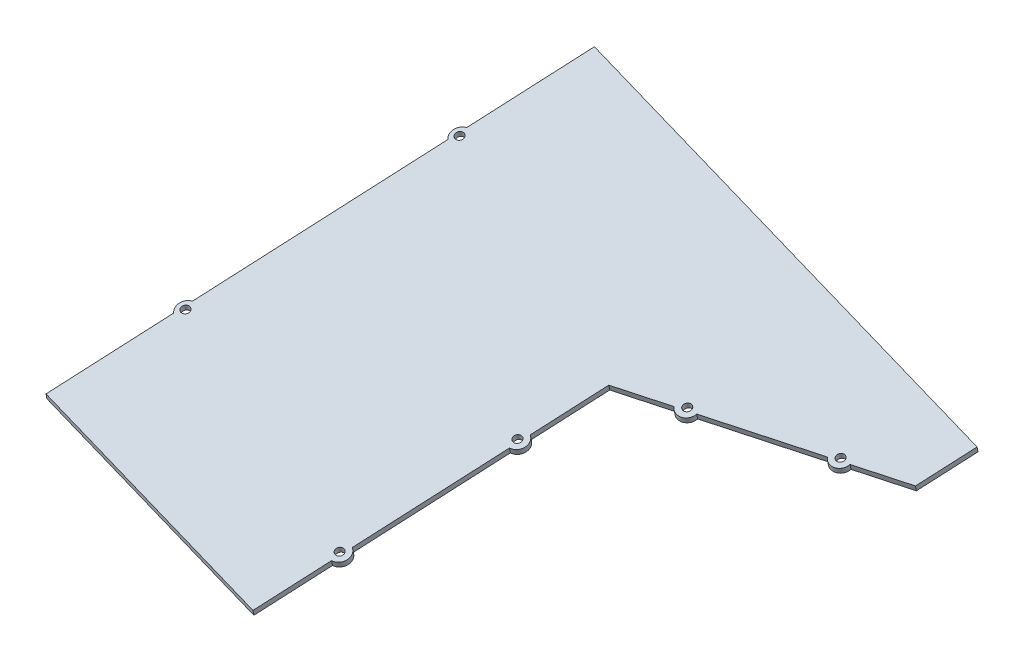
ISO-10303-21;
HEADER;
FILE_DESCRIPTION(('STEP AP214'),'2;1');
FILE_NAME('part.step','',(''),(''),'','','');
FILE_SCHEMA(('AUTOMOTIVE_DESIGN { 1 0 10303 214 1 1 1 1 }'));
ENDSEC;
DATA;
#1=APPLICATION_CONTEXT('core data for automotive mechanical design processes');
#2=APPLICATION_PROTOCOL_DEFINITION('international standard','automotive_design',2000,#1);
#3=PRODUCT_CONTEXT('',#1,'mechanical');
#4=PRODUCT('Part','Part','',(#3));
#5=PRODUCT_RELATED_PRODUCT_CATEGORY('part','',(#4));
#6=PRODUCT_DEFINITION_FORMATION('','',#4);
#7=PRODUCT_DEFINITION_CONTEXT('part definition',#1,'design');
#8=PRODUCT_DEFINITION('design','',#6,#7);
#9=PRODUCT_DEFINITION_SHAPE('','',#8);
#10=(LENGTH_UNIT() NAMED_UNIT(*) SI_UNIT(.MILLI.,.METRE.));
#11=(NAMED_UNIT(*) PLANE_ANGLE_UNIT() SI_UNIT($,.RADIAN.));
#12=(NAMED_UNIT(*) SI_UNIT($,.STERADIAN.) SOLID_ANGLE_UNIT());
#13=UNCERTAINTY_MEASURE_WITH_UNIT(LENGTH_MEASURE(1.E-05),#10,'distance_accuracy_value','');
#14=(GEOMETRIC_REPRESENTATION_CONTEXT(3) GLOBAL_UNCERTAINTY_ASSIGNED_CONTEXT((#13)) GLOBAL_UNIT_ASSIGNED_CONTEXT((#10,
#11,#12)) REPRESENTATION_CONTEXT('',''));
#15=CARTESIAN_POINT('',(0.,0.,0.));
#16=DIRECTION('',(0.,0.,1.));
#17=DIRECTION('',(1.,0.,0.));
#18=AXIS2_PLACEMENT_3D('',#15,#16,#17);
#19=CARTESIAN_POINT('',(354.536635556391,2890.18864910149,758.284890449049));
#20=DIRECTION('',(0.276994280237998,-0.3051480313952,0.911130532718045));
#21=DIRECTION('',(0.,-0.948233420354482,-0.317574212622561));
#22=AXIS2_PLACEMENT_3D('',#19,#20,#21);
#23=PLANE('',#22);
#24=DIRECTION('',(0.118950756916867,0.9518292240618,0.282616074650427));
#25=VECTOR('',#24,1.);
#26=CARTESIAN_POINT('',(327.832889597129,2888.16480171701,765.725330213703));
#27=LINE('',#26,#25);
#28=CARTESIAN_POINT('',(327.832889597129,2888.16480171701,765.725330213703));
#29=VERTEX_POINT('',#28);
#30=CARTESIAN_POINT('',(328.18974186788,2891.0202893892,766.573178437655));
#31=VERTEX_POINT('',#30);
#32=EDGE_CURVE('E174',#29,#31,#27,.T.);
#33=ORIENTED_EDGE('',*,*,#32,.F.);
#34=DIRECTION('',(-0.953480406796248,0.0300966303353959,0.299948840134641));
#35=VECTOR('',#34,1.);
#36=CARTESIAN_POINT('',(354.17978328564,2887.33316142931,757.437042225098));
#37=LINE('',#36,#35);
#38=CARTESIAN_POINT('',(354.17978328564,2887.33316142931,757.437042225098));
#39=VERTEX_POINT('',#38);
#40=EDGE_CURVE('E242',#39,#29,#37,.T.);
#41=ORIENTED_EDGE('',*,*,#40,.F.);
#42=DIRECTION('',(-0.118950756916867,-0.9518292240618,-0.282616074650427));
#43=VECTOR('',#42,1.);
#44=CARTESIAN_POINT('',(354.536635556391,2890.18864910149,758.284890449049));
#45=LINE('',#44,#43);
#46=CARTESIAN_POINT('',(354.536635556391,2890.18864910149,758.284890449049));
#47=VERTEX_POINT('',#46);
#48=EDGE_CURVE('E248',#47,#39,#45,.T.);
#49=ORIENTED_EDGE('',*,*,#48,.F.);
#50=DIRECTION('',(-0.953480406796248,0.0300966303353959,0.299948840134641));
#51=VECTOR('',#50,1.);
#52=CARTESIAN_POINT('',(354.536635556391,2890.18864910149,758.284890449049));
#53=LINE('',#52,#51);
#54=EDGE_CURVE('E50',#47,#31,#53,.T.);
#55=ORIENTED_EDGE('',*,*,#54,.T.);
#56=EDGE_LOOP('',(#33,#41,#49,#55));
#57=FACE_BOUND('',#56,.T.);
#58=ADVANCED_FACE('F33',(#57),#23,.T.);
#59=DIRECTION('',(0.118950756916867,0.9518292240618,0.282616074650427));
#60=VECTOR('',#59,1.);
#61=CARTESIAN_POINT('',(318.737266223133,2888.45190527195,768.586659782602));
#62=LINE('',#61,#60);
#63=CARTESIAN_POINT('',(319.094118493883,2891.30739294414,769.434508006553));
#64=VERTEX_POINT('',#63);
#65=CARTESIAN_POINT('',(318.737266223133,2888.45190527195,768.586659782602));
#66=VERTEX_POINT('',#65);
#67=EDGE_CURVE('E169',#64,#66,#62,.F.);
#68=ORIENTED_EDGE('',*,*,#67,.F.);
#69=CARTESIAN_POINT('',(266.400331116861,2892.97067351955,786.011083983763));
#70=VERTEX_POINT('',#69);
#71=EDGE_CURVE('E161',#64,#70,#53,.T.);
#72=ORIENTED_EDGE('',*,*,#71,.T.);
#73=DIRECTION('',(0.118950756916867,0.9518292240618,0.282616074650427));
#74=VECTOR('',#73,1.);
#75=CARTESIAN_POINT('',(266.043478846111,2890.11518584736,785.163235759812));
#76=LINE('',#75,#74);
#77=CARTESIAN_POINT('',(266.043478846111,2890.11518584736,785.163235759812));
#78=VERTEX_POINT('',#77);
#79=EDGE_CURVE('E11',#78,#70,#76,.T.);
#80=ORIENTED_EDGE('',*,*,#79,.F.);
#81=EDGE_CURVE('E58',#66,#78,#37,.T.);
#82=ORIENTED_EDGE('',*,*,#81,.F.);
#83=EDGE_LOOP('',(#68,#72,#80,#82));
#84=FACE_BOUND('',#83,.T.);
#85=ADVANCED_FACE('F170',(#84),#23,.T.);
#86=CARTESIAN_POINT('',(197.999438910728,2852.03828106166,952.657603691287));
#87=DIRECTION('',(0.97245536084359,-0.169146641830463,0.160374513947948));
#88=DIRECTION('',(0.171364746471442,0.985207655099562,0.));
#89=AXIS2_PLACEMENT_3D('',#86,#87,#88);
#90=PLANE('',#89);
#91=DIRECTION('',(0.118950756916867,0.9518292240618,0.282616074650427));
#92=VECTOR('',#91,1.);
#93=CARTESIAN_POINT('',(206.838278911782,2860.91545033674,908.424677921514));
#94=LINE('',#93,#92);
#95=CARTESIAN_POINT('',(206.838278911782,2860.91545033674,908.424677921514));
#96=VERTEX_POINT('',#95);
#97=CARTESIAN_POINT('',(207.195131182532,2863.77093800892,909.272526145465));
#98=VERTEX_POINT('',#97);
#99=EDGE_CURVE('E198',#96,#98,#94,.T.);
#100=ORIENTED_EDGE('',*,*,#99,.F.);
#101=DIRECTION('',(-0.200452709124791,-0.255754847030097,0.945731552622172));
#102=VECTOR('',#101,1.);
#103=CARTESIAN_POINT('',(197.642586639978,2849.18279338947,951.809755467336));
#104=LINE('',#103,#102);
#105=CARTESIAN_POINT('',(221.405269511798,2879.50127274274,839.697930863136));
#106=VERTEX_POINT('',#105);
#107=EDGE_CURVE('E281',#106,#96,#104,.T.);
#108=ORIENTED_EDGE('',*,*,#107,.F.);
#109=DIRECTION('',(0.118950756916867,0.9518292240618,0.282616074650427));
#110=VECTOR('',#109,1.);
#111=CARTESIAN_POINT('',(221.405269511798,2879.50127274274,839.697930863136));
#112=LINE('',#111,#110);
#113=CARTESIAN_POINT('',(221.762121782549,2882.35676041493,840.545779087087));
#114=VERTEX_POINT('',#113);
#115=EDGE_CURVE('E205',#114,#106,#112,.F.);
#116=ORIENTED_EDGE('',*,*,#115,.F.);
#117=DIRECTION('',(-0.200452709124791,-0.255754847030097,0.945731552622172));
#118=VECTOR('',#117,1.);
#119=CARTESIAN_POINT('',(197.999438910728,2852.03828106166,952.657603691287));
#120=LINE('',#119,#118);
#121=EDGE_CURVE('E266',#114,#98,#120,.T.);
#122=ORIENTED_EDGE('',*,*,#121,.T.);
#123=EDGE_LOOP('',(#100,#108,#116,#122));
#124=FACE_BOUND('',#123,.T.);
#125=ADVANCED_FACE('F349',(#124),#90,.T.);
#126=DIRECTION('',(0.118950756916867,0.9518292240618,0.282616074650427));
#127=VECTOR('',#126,1.);
#128=CARTESIAN_POINT('',(223.317466483593,2881.94101848701,830.676226846507));
#129=LINE('',#128,#127);
#130=CARTESIAN_POINT('',(223.317466483594,2881.94101848701,830.676226846507));
#131=VERTEX_POINT('',#130);
#132=CARTESIAN_POINT('',(223.674318754344,2884.79650615919,831.524075070458));
#133=VERTEX_POINT('',#132);
#134=EDGE_CURVE('E210',#131,#133,#129,.T.);
#135=ORIENTED_EDGE('',*,*,#134,.F.);
#136=CARTESIAN_POINT('',(230.600961783602,2891.23392969001,796.312853317316));
#137=VERTEX_POINT('',#136);
#138=EDGE_CURVE('E277',#137,#131,#104,.T.);
#139=ORIENTED_EDGE('',*,*,#138,.F.);
#140=DIRECTION('',(-0.118950756916867,-0.9518292240618,-0.282616074650427));
#141=VECTOR('',#140,1.);
#142=CARTESIAN_POINT('',(230.957814054353,2894.08941736219,797.160701541267));
#143=LINE('',#142,#141);
#144=CARTESIAN_POINT('',(230.957814054353,2894.08941736219,797.160701541268));
#145=VERTEX_POINT('',#144);
#146=EDGE_CURVE('E241',#145,#137,#143,.T.);
#147=ORIENTED_EDGE('',*,*,#146,.F.);
#148=EDGE_CURVE('E263',#145,#133,#120,.T.);
#149=ORIENTED_EDGE('',*,*,#148,.T.);
#150=EDGE_LOOP('',(#135,#139,#147,#149));
#151=FACE_BOUND('',#150,.T.);
#152=ADVANCED_FACE('F417',(#151),#90,.T.);
#153=CARTESIAN_POINT('',(66.7179651968433,2874.87307770877,931.007044308314));
#154=DIRECTION('',(-0.97245536084359,0.169146641830464,-0.160374513947948));
#155=DIRECTION('',(-0.171364746471442,-0.985207655099562,0.));
#156=AXIS2_PLACEMENT_3D('',#153,#154,#155);
#157=PLANE('',#156);
#158=DIRECTION('',(0.118950756916867,0.9518292240618,0.282616074650427));
#159=VECTOR('',#158,1.);
#160=CARTESIAN_POINT('',(78.1932208249036,2887.11401332224,874.335566547037));
#161=LINE('',#160,#159);
#162=CARTESIAN_POINT('',(78.1932208249036,2887.11401332224,874.335566547037));
#163=VERTEX_POINT('',#162);
#164=CARTESIAN_POINT('',(78.5500730956542,2889.96950099443,875.183414770989));
#165=VERTEX_POINT('',#164);
#166=EDGE_CURVE('E222',#163,#165,#161,.T.);
#167=ORIENTED_EDGE('',*,*,#166,.F.);
#168=DIRECTION('',(0.200452709124791,0.255754847030097,-0.945731552622172));
#169=VECTOR('',#168,1.);
#170=CARTESIAN_POINT('',(66.3611129260926,2872.01759003659,930.159196084363));
#171=LINE('',#170,#169);
#172=CARTESIAN_POINT('',(66.3611129260926,2872.01759003659,930.159196084363));
#173=VERTEX_POINT('',#172);
#174=EDGE_CURVE('E270',#173,#163,#171,.T.);
#175=ORIENTED_EDGE('',*,*,#174,.F.);
#176=DIRECTION('',(-0.118950756916867,-0.9518292240618,-0.282616074650427));
#177=VECTOR('',#176,1.);
#178=CARTESIAN_POINT('',(66.7179651968433,2874.87307770877,931.007044308314));
#179=LINE('',#178,#177);
#180=CARTESIAN_POINT('',(66.7179651968433,2874.87307770877,931.007044308314));
#181=VERTEX_POINT('',#180);
#182=EDGE_CURVE('E284',#181,#173,#179,.T.);
#183=ORIENTED_EDGE('',*,*,#182,.F.);
#184=DIRECTION('',(0.200452709124791,0.255754847030097,-0.945731552622172));
#185=VECTOR('',#184,1.);
#186=CARTESIAN_POINT('',(66.7179651968433,2874.87307770877,931.007044308314));
#187=LINE('',#186,#185);
#188=EDGE_CURVE('E256',#181,#165,#187,.T.);
#189=ORIENTED_EDGE('',*,*,#188,.T.);
#190=EDGE_LOOP('',(#167,#175,#183,#189));
#191=FACE_BOUND('',#190,.T.);
#192=ADVANCED_FACE('F396',(#191),#157,.T.);
#193=DIRECTION('',(0.118950756916867,0.9518292240618,0.282616074650427));
#194=VECTOR('',#193,1.);
#195=CARTESIAN_POINT('',(79.9291922077206,2889.32891526794,866.145291053394));
#196=LINE('',#195,#194);
#197=CARTESIAN_POINT('',(80.2860444784712,2892.18440294012,866.993139277345));
#198=VERTEX_POINT('',#197);
#199=CARTESIAN_POINT('',(79.9291922077206,2889.32891526794,866.145291053394));
#200=VERTEX_POINT('',#199);
#201=EDGE_CURVE('E217',#198,#200,#196,.F.);
#202=ORIENTED_EDGE('',*,*,#201,.F.);
#203=CARTESIAN_POINT('',(103.950260276093,2922.37724951143,755.345880202694));
#204=VERTEX_POINT('',#203);
#205=EDGE_CURVE('E259',#198,#204,#187,.T.);
#206=ORIENTED_EDGE('',*,*,#205,.T.);
#207=DIRECTION('',(0.118950756916867,0.9518292240618,0.282616074650427));
#208=VECTOR('',#207,1.);
#209=CARTESIAN_POINT('',(103.593408005343,2919.52176183925,754.498031978743));
#210=LINE('',#209,#208);
#211=CARTESIAN_POINT('',(103.593408005343,2919.52176183925,754.498031978743));
#212=VERTEX_POINT('',#211);
#213=EDGE_CURVE('E234',#212,#204,#210,.T.);
#214=ORIENTED_EDGE('',*,*,#213,.F.);
#215=EDGE_CURVE('E274',#200,#212,#171,.T.);
#216=ORIENTED_EDGE('',*,*,#215,.F.);
#217=EDGE_LOOP('',(#202,#206,#214,#216));
#218=FACE_BOUND('',#217,.T.);
#219=ADVANCED_FACE('F387',(#218),#157,.T.);
#220=DIRECTION('',(0.118950756916867,0.9518292240618,0.282616074650427));
#221=VECTOR('',#220,1.);
#222=CARTESIAN_POINT('',(105.32937938816,2921.73666378494,746.3077564851));
#223=LINE('',#222,#221);
#224=CARTESIAN_POINT('',(105.68623165891,2924.59215145713,747.155604709051));
#225=VERTEX_POINT('',#224);
#226=CARTESIAN_POINT('',(105.32937938816,2921.73666378494,746.3077564851));
#227=VERTEX_POINT('',#226);
#228=EDGE_CURVE('E229',#225,#227,#223,.F.);
#229=ORIENTED_EDGE('',*,*,#228,.F.);
#230=CARTESIAN_POINT('',(117.518339557721,2939.68857474279,691.331975171726));
#231=VERTEX_POINT('',#230);
#232=EDGE_CURVE('E260',#225,#231,#187,.T.);
#233=ORIENTED_EDGE('',*,*,#232,.T.);
#234=DIRECTION('',(-0.118950756916867,-0.9518292240618,-0.282616074650427));
#235=VECTOR('',#234,1.);
#236=CARTESIAN_POINT('',(117.518339557721,2939.68857474279,691.331975171726));
#237=LINE('',#236,#235);
#238=CARTESIAN_POINT('',(117.161487286971,2936.8330870706,690.484126947774));
#239=VERTEX_POINT('',#238);
#240=EDGE_CURVE('E269',#231,#239,#237,.T.);
#241=ORIENTED_EDGE('',*,*,#240,.T.);
#242=EDGE_CURVE('E250',#227,#239,#171,.T.);
#243=ORIENTED_EDGE('',*,*,#242,.F.);
#244=EDGE_LOOP('',(#229,#233,#241,#243));
#245=FACE_BOUND('',#244,.T.);
#246=ADVANCED_FACE('F35',(#245),#157,.T.);
#247=CARTESIAN_POINT('',(66.7179651968433,2874.87307770877,931.007044308314));
#248=DIRECTION('',(-0.200452709124792,-0.255754847030096,0.945731552622172));
#249=DIRECTION('',(0.,-0.965324375324192,-0.261053347814118));
#250=AXIS2_PLACEMENT_3D('',#247,#248,#249);
#251=PLANE('',#250);
#252=DIRECTION('',(-0.97245536084359,0.169146641830464,-0.160374513947948));
#253=VECTOR('',#252,1.);
#254=CARTESIAN_POINT('',(66.3611129260926,2872.01759003659,930.159196084363));
#255=LINE('',#254,#253);
#256=CARTESIAN_POINT('',(197.642586639978,2849.18279338947,951.809755467336));
#257=VERTEX_POINT('',#256);
#258=EDGE_CURVE('E280',#257,#173,#255,.T.);
#259=ORIENTED_EDGE('',*,*,#258,.F.);
#260=DIRECTION('',(-0.118950756916867,-0.9518292240618,-0.282616074650427));
#261=VECTOR('',#260,1.);
#262=CARTESIAN_POINT('',(197.999438910728,2852.03828106166,952.657603691287));
#263=LINE('',#262,#261);
#264=CARTESIAN_POINT('',(197.999438910728,2852.03828106166,952.657603691287));
#265=VERTEX_POINT('',#264);
#266=EDGE_CURVE('E286',#265,#257,#263,.T.);
#267=ORIENTED_EDGE('',*,*,#266,.F.);
#268=DIRECTION('',(-0.97245536084359,0.169146641830464,-0.160374513947948));
#269=VECTOR('',#268,1.);
#270=CARTESIAN_POINT('',(66.7179651968433,2874.87307770877,931.007044308314));
#271=LINE('',#270,#269);
#272=EDGE_CURVE('E265',#265,#181,#271,.T.);
#273=ORIENTED_EDGE('',*,*,#272,.T.);
#274=ORIENTED_EDGE('',*,*,#182,.T.);
#275=EDGE_LOOP('',(#259,#267,#273,#274));
#276=FACE_BOUND('',#275,.T.);
#277=ADVANCED_FACE('F401',(#276),#251,.T.);
#278=DIRECTION('',(0.118950756916867,0.9518292240618,0.282616074650427));
#279=VECTOR('',#278,1.);
#280=CARTESIAN_POINT('',(204.926081939986,2858.47570459248,917.446381938148));
#281=LINE('',#280,#279);
#282=CARTESIAN_POINT('',(205.282934210736,2861.33119226466,918.294230162099));
#283=VERTEX_POINT('',#282);
#284=CARTESIAN_POINT('',(204.926081939986,2858.47570459248,917.446381938148));
#285=VERTEX_POINT('',#284);
#286=EDGE_CURVE('E193',#283,#285,#281,.F.);
#287=ORIENTED_EDGE('',*,*,#286,.F.);
#288=EDGE_CURVE('E262',#283,#265,#120,.T.);
#289=ORIENTED_EDGE('',*,*,#288,.T.);
#290=ORIENTED_EDGE('',*,*,#266,.T.);
#291=EDGE_CURVE('E276',#285,#257,#104,.T.);
#292=ORIENTED_EDGE('',*,*,#291,.F.);
#293=EDGE_LOOP('',(#287,#289,#290,#292));
#294=FACE_BOUND('',#293,.T.);
#295=ADVANCED_FACE('F405',(#294),#90,.T.);
#296=CARTESIAN_POINT('',(117.518339557721,2939.68857474279,691.331975171726));
#297=DIRECTION('',(0.200452709124792,0.255754847030096,-0.945731552622172));
#298=DIRECTION('',(0.,0.965324375324192,0.261053347814118));
#299=AXIS2_PLACEMENT_3D('',#296,#297,#298);
#300=PLANE('',#299);
#301=DIRECTION('',(0.97245536084359,-0.169146641830464,0.160374513947949));
#302=VECTOR('',#301,1.);
#303=CARTESIAN_POINT('',(117.161487286971,2936.8330870706,690.484126947774));
#304=LINE('',#303,#302);
#305=CARTESIAN_POINT('',(359.886345353531,2894.61408526972,730.513605629182));
#306=VERTEX_POINT('',#305);
#307=EDGE_CURVE('E273',#239,#306,#304,.T.);
#308=ORIENTED_EDGE('',*,*,#307,.F.);
#309=ORIENTED_EDGE('',*,*,#240,.F.);
#310=DIRECTION('',(0.97245536084359,-0.169146641830464,0.160374513947949));
#311=VECTOR('',#310,1.);
#312=CARTESIAN_POINT('',(117.518339557721,2939.68857474279,691.331975171726));
#313=LINE('',#312,#311);
#314=CARTESIAN_POINT('',(360.243197624281,2897.4695729419,731.361453853133));
#315=VERTEX_POINT('',#314);
#316=EDGE_CURVE('E258',#231,#315,#313,.T.);
#317=ORIENTED_EDGE('',*,*,#316,.T.);
#318=DIRECTION('',(-0.118950756916867,-0.9518292240618,-0.282616074650427));
#319=VECTOR('',#318,1.);
#320=CARTESIAN_POINT('',(360.243197624281,2897.4695729419,731.361453853133));
#321=LINE('',#320,#319);
#322=EDGE_CURVE('E251',#315,#306,#321,.T.);
#323=ORIENTED_EDGE('',*,*,#322,.T.);
#324=EDGE_LOOP('',(#308,#309,#317,#323));
#325=FACE_BOUND('',#324,.T.);
#326=ADVANCED_FACE('F377',(#325),#300,.T.);
#327=CARTESIAN_POINT('',(357.737492723045,2862.57110876867,849.951430063882));
#328=DIRECTION('',(-0.118950756916868,-0.9518292240618,-0.282616074650427));
#329=DIRECTION('',(0.,0.284636952950701,-0.958635386898971));
#330=AXIS2_PLACEMENT_3D('',#327,#328,#329);
#331=PLANE('',#330);
#332=CARTESIAN_POINT('',(221.259537227181,2883.83035324981,835.794365307851));
#333=DIRECTION('',(-0.118950756916868,-0.9518292240618,-0.282616074650427));
#334=DIRECTION('',(0.,0.284636952950701,-0.958635386898971));
#335=AXIS2_PLACEMENT_3D('',#332,#333,#334);
#336=CIRCLE('',#335,2.09999999798137);
#337=CARTESIAN_POINT('',(221.259537227181,2884.42809085043,833.781230997298));
#338=VERTEX_POINT('',#337);
#339=EDGE_CURVE('E178',#338,#338,#336,.T.);
#340=ORIENTED_EDGE('',*,*,#339,.T.);
#341=EDGE_LOOP('',(#340));
#342=FACE_BOUND('',#341,.T.);
#343=CARTESIAN_POINT('',(261.437028009505,2893.57194734411,786.075052969136));
#344=DIRECTION('',(-0.118950756916868,-0.9518292240618,-0.282616074650427));
#345=DIRECTION('',(0.,0.284636952950701,-0.958635386898971));
#346=AXIS2_PLACEMENT_3D('',#343,#344,#345);
#347=CIRCLE('',#346,2.09999999786849);
#348=CARTESIAN_POINT('',(261.437028009505,2894.1696849447,784.061918658691));
#349=VERTEX_POINT('',#348);
#350=EDGE_CURVE('E310',#349,#349,#347,.T.);
#351=ORIENTED_EDGE('',*,*,#350,.T.);
#352=EDGE_LOOP('',(#351));
#353=FACE_BOUND('',#352,.T.);
#354=CARTESIAN_POINT('',(323.226438760524,2891.62156321376,766.637147423027));
#355=DIRECTION('',(-0.118950756916868,-0.9518292240618,-0.282616074650427));
#356=DIRECTION('',(0.,0.284636952950701,-0.958635386898971));
#357=AXIS2_PLACEMENT_3D('',#354,#355,#356);
#358=CIRCLE('',#357,2.09999999786752);
#359=CARTESIAN_POINT('',(323.226438760524,2892.21930081435,764.624013112583));
#360=VERTEX_POINT('',#359);
#361=EDGE_CURVE('E307',#360,#360,#358,.T.);
#362=ORIENTED_EDGE('',*,*,#361,.T.);
#363=EDGE_LOOP('',(#362));
#364=FACE_BOUND('',#363,.T.);
#365=CARTESIAN_POINT('',(80.8767418283281,2890.82323200453,871.328838795089));
#366=DIRECTION('',(-0.118950756916868,-0.9518292240618,-0.282616074650427));
#367=DIRECTION('',(0.,0.284636952950701,-0.958635386898971));
#368=AXIS2_PLACEMENT_3D('',#365,#366,#367);
#369=CIRCLE('',#368,2.09999999832051);
#370=CARTESIAN_POINT('',(80.8767418283281,2891.42096960525,869.315704484211));
#371=VERTEX_POINT('',#370);
#372=EDGE_CURVE('E304',#371,#371,#369,.T.);
#373=ORIENTED_EDGE('',*,*,#372,.T.);
#374=EDGE_LOOP('',(#373));
#375=FACE_BOUND('',#374,.T.);
#376=CARTESIAN_POINT('',(204.780349655369,2862.80478509954,913.54281638286));
#377=DIRECTION('',(-0.118950756916868,-0.9518292240618,-0.282616074650427));
#378=DIRECTION('',(0.,0.284636952950701,-0.958635386898971));
#379=AXIS2_PLACEMENT_3D('',#376,#377,#378);
#380=CIRCLE('',#379,2.09999999798364);
#381=CARTESIAN_POINT('',(204.780349655369,2863.40252270016,911.529682072305));
#382=VERTEX_POINT('',#381);
#383=EDGE_CURVE('E300',#382,#382,#380,.T.);
#384=ORIENTED_EDGE('',*,*,#383,.T.);
#385=EDGE_LOOP('',(#384));
#386=FACE_BOUND('',#385,.T.);
#387=CARTESIAN_POINT('',(106.276929008767,2923.23098052154,751.491304226795));
#388=DIRECTION('',(-0.118950756916868,-0.9518292240618,-0.282616074650427));
#389=DIRECTION('',(0.,0.284636952950701,-0.958635386898971));
#390=AXIS2_PLACEMENT_3D('',#387,#388,#389);
#391=CIRCLE('',#390,2.09999999832055);
#392=CARTESIAN_POINT('',(106.276929008767,2923.82871812225,749.478169915917));
#393=VERTEX_POINT('',#392);
#394=EDGE_CURVE('E296',#393,#393,#391,.T.);
#395=ORIENTED_EDGE('',*,*,#394,.T.);
#396=EDGE_LOOP('',(#395));
#397=FACE_BOUND('',#396,.T.);
#398=ORIENTED_EDGE('',*,*,#71,.F.);
#399=CARTESIAN_POINT('',(323.226438760524,2891.62156321376,766.637147423027));
#400=DIRECTION('',(0.118950756916867,0.9518292240618,0.282616074650427));
#401=DIRECTION('',(0.,0.2846369529507,-0.958635386898971));
#402=AXIS2_PLACEMENT_3D('',#399,#400,#401);
#403=CIRCLE('',#402,4.99999999786758);
#404=EDGE_CURVE('E164',#64,#31,#403,.T.);
#405=ORIENTED_EDGE('',*,*,#404,.T.);
#406=ORIENTED_EDGE('',*,*,#54,.F.);
#407=DIRECTION('',(-0.200452709124783,-0.255754847030104,0.945731552622172));
#408=VECTOR('',#407,1.);
#409=CARTESIAN_POINT('',(360.243197624281,2897.4695729419,731.361453853133));
#410=LINE('',#409,#408);
#411=EDGE_CURVE('E238',#315,#47,#410,.T.);
#412=ORIENTED_EDGE('',*,*,#411,.F.);
#413=ORIENTED_EDGE('',*,*,#316,.F.);
#414=ORIENTED_EDGE('',*,*,#232,.F.);
#415=CARTESIAN_POINT('',(107.249384369611,2923.06183387971,751.651678740743));
#416=DIRECTION('',(0.118950756916867,0.9518292240618,0.282616074650427));
#417=DIRECTION('',(0.,-0.2846369529507,0.958635386898971));
#418=AXIS2_PLACEMENT_3D('',#415,#416,#417);
#419=CIRCLE('',#418,4.99999999831995);
#420=EDGE_CURVE('E225',#225,#204,#419,.T.);
#421=ORIENTED_EDGE('',*,*,#420,.T.);
#422=ORIENTED_EDGE('',*,*,#205,.F.);
#423=CARTESIAN_POINT('',(81.8491971891719,2890.6540853627,871.489213309037));
#424=DIRECTION('',(0.118950756916867,0.9518292240618,0.282616074650427));
#425=DIRECTION('',(0.,0.2846369529507,-0.958635386898971));
#426=AXIS2_PLACEMENT_3D('',#423,#424,#425);
#427=CIRCLE('',#426,4.99999999831992);
#428=EDGE_CURVE('E213',#198,#165,#427,.T.);
#429=ORIENTED_EDGE('',*,*,#428,.T.);
#430=ORIENTED_EDGE('',*,*,#188,.F.);
#431=ORIENTED_EDGE('',*,*,#272,.F.);
#432=ORIENTED_EDGE('',*,*,#288,.F.);
#433=CARTESIAN_POINT('',(204.780349655369,2862.80478509954,913.54281638286));
#434=DIRECTION('',(0.118950756916867,0.9518292240618,0.282616074650427));
#435=DIRECTION('',(0.,0.2846369529507,-0.958635386898971));
#436=AXIS2_PLACEMENT_3D('',#433,#434,#435);
#437=CIRCLE('',#436,4.99999999798343);
#438=EDGE_CURVE('E188',#283,#98,#437,.T.);
#439=ORIENTED_EDGE('',*,*,#438,.T.);
#440=ORIENTED_EDGE('',*,*,#121,.F.);
#441=CARTESIAN_POINT('',(221.259537227181,2883.83035324981,835.794365307851));
#442=DIRECTION('',(0.118950756916867,0.9518292240618,0.282616074650427));
#443=DIRECTION('',(0.,-0.2846369529507,0.958635386898971));
#444=AXIS2_PLACEMENT_3D('',#441,#442,#443);
#445=CIRCLE('',#444,4.9999999979812);
#446=EDGE_CURVE('E201',#114,#133,#445,.T.);
#447=ORIENTED_EDGE('',*,*,#446,.T.);
#448=ORIENTED_EDGE('',*,*,#148,.F.);
#449=CARTESIAN_POINT('',(257.304707742863,2893.25777707449,788.872413552663));
#450=VERTEX_POINT('',#449);
#451=EDGE_CURVE('E167',#450,#145,#53,.T.);
#452=ORIENTED_EDGE('',*,*,#451,.F.);
#453=CARTESIAN_POINT('',(261.437028009505,2893.57194734411,786.075052969136));
#454=DIRECTION('',(0.118950756916867,0.9518292240618,0.282616074650427));
#455=DIRECTION('',(0.,-0.2846369529507,0.958635386898971));
#456=AXIS2_PLACEMENT_3D('',#453,#454,#455);
#457=CIRCLE('',#456,4.99999999786847);
#458=EDGE_CURVE('E166',#450,#70,#457,.T.);
#459=ORIENTED_EDGE('',*,*,#458,.T.);
#460=EDGE_LOOP('',(#398,#405,#406,#412,#413,#414,#421,#422,#429,#430,#431,#432,#439,#440,#447,
#448,#452,#459));
#461=FACE_BOUND('',#460,.T.);
#462=ADVANCED_FACE('F162',(#342,#353,#364,#375,#386,#397,#461),#331,.F.);
#463=CARTESIAN_POINT('',(357.380640452295,2859.71562109648,849.103581839931));
#464=DIRECTION('',(-0.118950756916868,-0.9518292240618,-0.282616074650427));
#465=DIRECTION('',(0.,0.284636952950701,-0.958635386898971));
#466=AXIS2_PLACEMENT_3D('',#463,#464,#465);
#467=PLANE('',#466);
#468=CARTESIAN_POINT('',(220.902684956431,2880.97486557762,834.946517083899));
#469=DIRECTION('',(-0.118950756916868,-0.9518292240618,-0.282616074650427));
#470=DIRECTION('',(0.,0.284636952950701,-0.958635386898971));
#471=AXIS2_PLACEMENT_3D('',#468,#469,#470);
#472=CIRCLE('',#471,2.09999999798137);
#473=CARTESIAN_POINT('',(220.902684956431,2881.57260317824,832.933382773347));
#474=VERTEX_POINT('',#473);
#475=EDGE_CURVE('E37',#474,#474,#472,.T.);
#476=ORIENTED_EDGE('',*,*,#475,.F.);
#477=EDGE_LOOP('',(#476));
#478=FACE_BOUND('',#477,.T.);
#479=CARTESIAN_POINT('',(261.080175738755,2890.71645967193,785.227204745185));
#480=DIRECTION('',(-0.118950756916868,-0.9518292240618,-0.282616074650427));
#481=DIRECTION('',(0.,0.284636952950701,-0.958635386898971));
#482=AXIS2_PLACEMENT_3D('',#479,#480,#481);
#483=CIRCLE('',#482,2.09999999786849);
#484=CARTESIAN_POINT('',(261.080175738755,2891.31419727252,783.21407043474));
#485=VERTEX_POINT('',#484);
#486=EDGE_CURVE('E308',#485,#485,#483,.T.);
#487=ORIENTED_EDGE('',*,*,#486,.F.);
#488=EDGE_LOOP('',(#487));
#489=FACE_BOUND('',#488,.T.);
#490=CARTESIAN_POINT('',(322.869586489774,2888.76607554158,765.789299199076));
#491=DIRECTION('',(-0.118950756916868,-0.9518292240618,-0.282616074650427));
#492=DIRECTION('',(0.,0.284636952950701,-0.958635386898971));
#493=AXIS2_PLACEMENT_3D('',#490,#491,#492);
#494=CIRCLE('',#493,2.09999999786752);
#495=CARTESIAN_POINT('',(322.869586489774,2889.36381314216,763.776164888632));
#496=VERTEX_POINT('',#495);
#497=EDGE_CURVE('E305',#496,#496,#494,.T.);
#498=ORIENTED_EDGE('',*,*,#497,.F.);
#499=EDGE_LOOP('',(#498));
#500=FACE_BOUND('',#499,.T.);
#501=CARTESIAN_POINT('',(80.5198895575775,2887.96774433234,870.480990571137));
#502=DIRECTION('',(-0.118950756916868,-0.9518292240618,-0.282616074650427));
#503=DIRECTION('',(0.,0.284636952950701,-0.958635386898971));
#504=AXIS2_PLACEMENT_3D('',#501,#502,#503);
#505=CIRCLE('',#504,2.09999999832051);
#506=CARTESIAN_POINT('',(80.5198895575775,2888.56548193306,868.46785626026));
#507=VERTEX_POINT('',#506);
#508=EDGE_CURVE('E301',#507,#507,#505,.T.);
#509=ORIENTED_EDGE('',*,*,#508,.F.);
#510=EDGE_LOOP('',(#509));
#511=FACE_BOUND('',#510,.T.);
#512=CARTESIAN_POINT('',(204.423497384618,2859.94929742735,912.694968158909));
#513=DIRECTION('',(-0.118950756916868,-0.9518292240618,-0.282616074650427));
#514=DIRECTION('',(0.,0.284636952950701,-0.958635386898971));
#515=AXIS2_PLACEMENT_3D('',#512,#513,#514);
#516=CIRCLE('',#515,2.09999999798364);
#517=CARTESIAN_POINT('',(204.423497384618,2860.54703502798,910.681833848354));
#518=VERTEX_POINT('',#517);
#519=EDGE_CURVE('E297',#518,#518,#516,.T.);
#520=ORIENTED_EDGE('',*,*,#519,.F.);
#521=EDGE_LOOP('',(#520));
#522=FACE_BOUND('',#521,.T.);
#523=CARTESIAN_POINT('',(105.920076738016,2920.37549284935,750.643456002843));
#524=DIRECTION('',(-0.118950756916868,-0.9518292240618,-0.282616074650427));
#525=DIRECTION('',(0.,0.284636952950701,-0.958635386898971));
#526=AXIS2_PLACEMENT_3D('',#523,#524,#525);
#527=CIRCLE('',#526,2.09999999832055);
#528=CARTESIAN_POINT('',(105.920076738016,2920.97323045007,748.630321691965));
#529=VERTEX_POINT('',#528);
#530=EDGE_CURVE('E293',#529,#529,#527,.T.);
#531=ORIENTED_EDGE('',*,*,#530,.F.);
#532=EDGE_LOOP('',(#531));
#533=FACE_BOUND('',#532,.T.);
#534=ORIENTED_EDGE('',*,*,#40,.T.);
#535=CARTESIAN_POINT('',(322.869586489774,2888.76607554158,765.789299199076));
#536=DIRECTION('',(0.118950756916867,0.9518292240618,0.282616074650427));
#537=DIRECTION('',(0.,0.2846369529507,-0.958635386898971));
#538=AXIS2_PLACEMENT_3D('',#535,#536,#537);
#539=CIRCLE('',#538,4.99999999786758);
#540=EDGE_CURVE('E175',#66,#29,#539,.T.);
#541=ORIENTED_EDGE('',*,*,#540,.F.);
#542=ORIENTED_EDGE('',*,*,#81,.T.);
#543=CARTESIAN_POINT('',(261.080175738755,2890.71645967193,785.227204745185));
#544=DIRECTION('',(0.118950756916867,0.9518292240618,0.282616074650427));
#545=DIRECTION('',(0.,-0.2846369529507,0.958635386898971));
#546=AXIS2_PLACEMENT_3D('',#543,#544,#545);
#547=CIRCLE('',#546,4.99999999786847);
#548=CARTESIAN_POINT('',(256.947855472113,2890.4022894023,788.024565328711));
#549=VERTEX_POINT('',#548);
#550=EDGE_CURVE('E185',#549,#78,#547,.T.);
#551=ORIENTED_EDGE('',*,*,#550,.F.);
#552=EDGE_CURVE('E236',#549,#137,#37,.T.);
#553=ORIENTED_EDGE('',*,*,#552,.T.);
#554=ORIENTED_EDGE('',*,*,#138,.T.);
#555=CARTESIAN_POINT('',(220.902684956431,2880.97486557762,834.946517083899));
#556=DIRECTION('',(0.118950756916867,0.9518292240618,0.282616074650427));
#557=DIRECTION('',(0.,-0.2846369529507,0.958635386898971));
#558=AXIS2_PLACEMENT_3D('',#555,#556,#557);
#559=CIRCLE('',#558,4.9999999979812);
#560=EDGE_CURVE('E202',#106,#131,#559,.T.);
#561=ORIENTED_EDGE('',*,*,#560,.F.);
#562=ORIENTED_EDGE('',*,*,#107,.T.);
#563=CARTESIAN_POINT('',(204.423497384618,2859.94929742735,912.694968158909));
#564=DIRECTION('',(0.118950756916867,0.9518292240618,0.282616074650427));
#565=DIRECTION('',(0.,0.2846369529507,-0.958635386898971));
#566=AXIS2_PLACEMENT_3D('',#563,#564,#565);
#567=CIRCLE('',#566,4.99999999798343);
#568=EDGE_CURVE('E190',#285,#96,#567,.T.);
#569=ORIENTED_EDGE('',*,*,#568,.F.);
#570=ORIENTED_EDGE('',*,*,#291,.T.);
#571=ORIENTED_EDGE('',*,*,#258,.T.);
#572=ORIENTED_EDGE('',*,*,#174,.T.);
#573=CARTESIAN_POINT('',(81.4923449184213,2887.79859769051,870.641365085085));
#574=DIRECTION('',(0.118950756916867,0.9518292240618,0.282616074650427));
#575=DIRECTION('',(0.,0.2846369529507,-0.958635386898971));
#576=AXIS2_PLACEMENT_3D('',#573,#574,#575);
#577=CIRCLE('',#576,4.99999999831992);
#578=EDGE_CURVE('E214',#200,#163,#577,.T.);
#579=ORIENTED_EDGE('',*,*,#578,.F.);
#580=ORIENTED_EDGE('',*,*,#215,.T.);
#581=CARTESIAN_POINT('',(106.89253209886,2920.20634620752,750.803830516791));
#582=DIRECTION('',(0.118950756916867,0.9518292240618,0.282616074650427));
#583=DIRECTION('',(0.,-0.2846369529507,0.958635386898971));
#584=AXIS2_PLACEMENT_3D('',#581,#582,#583);
#585=CIRCLE('',#584,4.99999999831995);
#586=EDGE_CURVE('E226',#227,#212,#585,.T.);
#587=ORIENTED_EDGE('',*,*,#586,.F.);
#588=ORIENTED_EDGE('',*,*,#242,.T.);
#589=ORIENTED_EDGE('',*,*,#307,.T.);
#590=DIRECTION('',(-0.200452709124783,-0.255754847030104,0.945731552622172));
#591=VECTOR('',#590,1.);
#592=CARTESIAN_POINT('',(359.886345353531,2894.61408526972,730.513605629182));
#593=LINE('',#592,#591);
#594=EDGE_CURVE('E245',#306,#39,#593,.T.);
#595=ORIENTED_EDGE('',*,*,#594,.T.);
#596=EDGE_LOOP('',(#534,#541,#542,#551,#553,#554,#561,#562,#569,#570,#571,#572,#579,#580,#587,
#588,#589,#595));
#597=FACE_BOUND('',#596,.T.);
#598=ADVANCED_FACE('F354',(#478,#489,#500,#511,#522,#533,#597),#467,.T.);
#599=DIRECTION('',(0.118950756916867,0.9518292240618,0.282616074650427));
#600=VECTOR('',#599,1.);
#601=CARTESIAN_POINT('',(256.947855472113,2890.4022894023,788.024565328711));
#602=LINE('',#601,#600);
#603=EDGE_CURVE('E42',#450,#549,#602,.F.);
#604=ORIENTED_EDGE('',*,*,#603,.F.);
#605=ORIENTED_EDGE('',*,*,#451,.T.);
#606=ORIENTED_EDGE('',*,*,#146,.T.);
#607=ORIENTED_EDGE('',*,*,#552,.F.);
#608=EDGE_LOOP('',(#604,#605,#606,#607));
#609=FACE_BOUND('',#608,.T.);
#610=ADVANCED_FACE('F345',(#609),#23,.T.);
#611=CARTESIAN_POINT('',(360.243197624281,2897.4695729419,731.361453853133));
#612=DIRECTION('',(0.972455360843591,-0.169146641830461,0.160374513947939));
#613=DIRECTION('',(0.17136474647144,0.985207655099563,0.));
#614=AXIS2_PLACEMENT_3D('',#611,#612,#613);
#615=PLANE('',#614);
#616=ORIENTED_EDGE('',*,*,#594,.F.);
#617=ORIENTED_EDGE('',*,*,#322,.F.);
#618=ORIENTED_EDGE('',*,*,#411,.T.);
#619=ORIENTED_EDGE('',*,*,#48,.T.);
#620=EDGE_LOOP('',(#616,#617,#618,#619));
#621=FACE_BOUND('',#620,.T.);
#622=ADVANCED_FACE('F353',(#621),#615,.T.);
#623=CARTESIAN_POINT('',(106.89253209886,2920.20634620752,750.803830516791));
#624=DIRECTION('',(0.118950756916867,0.9518292240618,0.282616074650427));
#625=DIRECTION('',(0.,-0.2846369529507,0.958635386898971));
#626=AXIS2_PLACEMENT_3D('',#623,#624,#625);
#627=CYLINDRICAL_SURFACE('',#626,4.99999999831995);
#628=ORIENTED_EDGE('',*,*,#586,.T.);
#629=ORIENTED_EDGE('',*,*,#213,.T.);
#630=ORIENTED_EDGE('',*,*,#420,.F.);
#631=ORIENTED_EDGE('',*,*,#228,.T.);
#632=EDGE_LOOP('',(#628,#629,#630,#631));
#633=FACE_BOUND('',#632,.T.);
#634=ADVANCED_FACE('F360',(#633),#627,.T.);
#635=CARTESIAN_POINT('',(81.4923449184213,2887.79859769051,870.641365085085));
#636=DIRECTION('',(0.118950756916867,0.9518292240618,0.282616074650427));
#637=DIRECTION('',(0.,-0.2846369529507,0.958635386898971));
#638=AXIS2_PLACEMENT_3D('',#635,#636,#637);
#639=CYLINDRICAL_SURFACE('',#638,4.99999999831992);
#640=ORIENTED_EDGE('',*,*,#578,.T.);
#641=ORIENTED_EDGE('',*,*,#166,.T.);
#642=ORIENTED_EDGE('',*,*,#428,.F.);
#643=ORIENTED_EDGE('',*,*,#201,.T.);
#644=EDGE_LOOP('',(#640,#641,#642,#643));
#645=FACE_BOUND('',#644,.T.);
#646=ADVANCED_FACE('F392',(#645),#639,.T.);
#647=CARTESIAN_POINT('',(220.902684956431,2880.97486557762,834.946517083899));
#648=DIRECTION('',(0.118950756916867,0.9518292240618,0.282616074650427));
#649=DIRECTION('',(0.,-0.2846369529507,0.958635386898971));
#650=AXIS2_PLACEMENT_3D('',#647,#648,#649);
#651=CYLINDRICAL_SURFACE('',#650,4.9999999979812);
#652=ORIENTED_EDGE('',*,*,#560,.T.);
#653=ORIENTED_EDGE('',*,*,#134,.T.);
#654=ORIENTED_EDGE('',*,*,#446,.F.);
#655=ORIENTED_EDGE('',*,*,#115,.T.);
#656=EDGE_LOOP('',(#652,#653,#654,#655));
#657=FACE_BOUND('',#656,.T.);
#658=ADVANCED_FACE('F413',(#657),#651,.T.);
#659=CARTESIAN_POINT('',(204.423497384618,2859.94929742735,912.694968158909));
#660=DIRECTION('',(0.118950756916867,0.9518292240618,0.282616074650427));
#661=DIRECTION('',(0.,-0.2846369529507,0.958635386898971));
#662=AXIS2_PLACEMENT_3D('',#659,#660,#661);
#663=CYLINDRICAL_SURFACE('',#662,4.99999999798343);
#664=ORIENTED_EDGE('',*,*,#568,.T.);
#665=ORIENTED_EDGE('',*,*,#99,.T.);
#666=ORIENTED_EDGE('',*,*,#438,.F.);
#667=ORIENTED_EDGE('',*,*,#286,.T.);
#668=EDGE_LOOP('',(#664,#665,#666,#667));
#669=FACE_BOUND('',#668,.T.);
#670=ADVANCED_FACE('F407',(#669),#663,.T.);
#671=CARTESIAN_POINT('',(261.080175738755,2890.71645967193,785.227204745185));
#672=DIRECTION('',(0.118950756916867,0.9518292240618,0.282616074650427));
#673=DIRECTION('',(0.,-0.2846369529507,0.958635386898971));
#674=AXIS2_PLACEMENT_3D('',#671,#672,#673);
#675=CYLINDRICAL_SURFACE('',#674,4.99999999786847);
#676=ORIENTED_EDGE('',*,*,#550,.T.);
#677=ORIENTED_EDGE('',*,*,#79,.T.);
#678=ORIENTED_EDGE('',*,*,#458,.F.);
#679=ORIENTED_EDGE('',*,*,#603,.T.);
#680=EDGE_LOOP('',(#676,#677,#678,#679));
#681=FACE_BOUND('',#680,.T.);
#682=ADVANCED_FACE('F340',(#681),#675,.T.);
#683=CARTESIAN_POINT('',(322.869586489774,2888.76607554158,765.789299199076));
#684=DIRECTION('',(0.118950756916867,0.9518292240618,0.282616074650427));
#685=DIRECTION('',(0.,-0.2846369529507,0.958635386898971));
#686=AXIS2_PLACEMENT_3D('',#683,#684,#685);
#687=CYLINDRICAL_SURFACE('',#686,4.99999999786758);
#688=ORIENTED_EDGE('',*,*,#540,.T.);
#689=ORIENTED_EDGE('',*,*,#32,.T.);
#690=ORIENTED_EDGE('',*,*,#404,.F.);
#691=ORIENTED_EDGE('',*,*,#67,.T.);
#692=EDGE_LOOP('',(#688,#689,#690,#691));
#693=FACE_BOUND('',#692,.T.);
#694=ADVANCED_FACE('F177',(#693),#687,.T.);
#695=CARTESIAN_POINT('',(95.2774509321015,2835.21451930545,725.357554448277));
#696=DIRECTION('',(0.118950756916867,0.9518292240618,0.282616074650427));
#697=DIRECTION('',(0.,-0.2846369529507,0.958635386898972));
#698=AXIS2_PLACEMENT_3D('',#695,#696,#697);
#699=CYLINDRICAL_SURFACE('',#698,2.09999999832055);
#700=ORIENTED_EDGE('',*,*,#530,.T.);
#701=EDGE_LOOP('',(#700));
#702=FACE_BOUND('',#701,.T.);
#703=ORIENTED_EDGE('',*,*,#394,.F.);
#704=EDGE_LOOP('',(#703));
#705=FACE_BOUND('',#704,.T.);
#706=ADVANCED_FACE('F328',(#702,#705),#699,.F.);
#707=CARTESIAN_POINT('',(193.780871578703,2774.78832388345,887.409066604343));
#708=DIRECTION('',(0.118950756916867,0.9518292240618,0.282616074650427));
#709=DIRECTION('',(0.,-0.2846369529507,0.958635386898972));
#710=AXIS2_PLACEMENT_3D('',#707,#708,#709);
#711=CYLINDRICAL_SURFACE('',#710,2.09999999798364);
#712=ORIENTED_EDGE('',*,*,#519,.T.);
#713=EDGE_LOOP('',(#712));
#714=FACE_BOUND('',#713,.T.);
#715=ORIENTED_EDGE('',*,*,#383,.F.);
#716=EDGE_LOOP('',(#715));
#717=FACE_BOUND('',#716,.T.);
#718=ADVANCED_FACE('F330',(#714,#717),#711,.F.);
#719=CARTESIAN_POINT('',(69.8772637516626,2802.80677078844,845.195089016571));
#720=DIRECTION('',(0.118950756916867,0.9518292240618,0.282616074650427));
#721=DIRECTION('',(0.,-0.2846369529507,0.958635386898972));
#722=AXIS2_PLACEMENT_3D('',#719,#720,#721);
#723=CYLINDRICAL_SURFACE('',#722,2.09999999832051);
#724=ORIENTED_EDGE('',*,*,#508,.T.);
#725=EDGE_LOOP('',(#724));
#726=FACE_BOUND('',#725,.T.);
#727=ORIENTED_EDGE('',*,*,#372,.F.);
#728=EDGE_LOOP('',(#727));
#729=FACE_BOUND('',#728,.T.);
#730=ADVANCED_FACE('F337',(#726,#729),#723,.F.);
#731=CARTESIAN_POINT('',(312.226960683859,2803.60510199768,740.50339764451));
#732=DIRECTION('',(0.118950756916867,0.9518292240618,0.282616074650427));
#733=DIRECTION('',(0.,-0.2846369529507,0.958635386898972));
#734=AXIS2_PLACEMENT_3D('',#731,#732,#733);
#735=CYLINDRICAL_SURFACE('',#734,2.09999999786752);
#736=ORIENTED_EDGE('',*,*,#497,.T.);
#737=EDGE_LOOP('',(#736));
#738=FACE_BOUND('',#737,.T.);
#739=ORIENTED_EDGE('',*,*,#361,.F.);
#740=EDGE_LOOP('',(#739));
#741=FACE_BOUND('',#740,.T.);
#742=ADVANCED_FACE('F447',(#738,#741),#735,.F.);
#743=CARTESIAN_POINT('',(250.43754993284,2805.55548612803,759.941303190619));
#744=DIRECTION('',(0.118950756916867,0.9518292240618,0.282616074650427));
#745=DIRECTION('',(0.,-0.2846369529507,0.958635386898972));
#746=AXIS2_PLACEMENT_3D('',#743,#744,#745);
#747=CYLINDRICAL_SURFACE('',#746,2.09999999786849);
#748=ORIENTED_EDGE('',*,*,#486,.T.);
#749=EDGE_LOOP('',(#748));
#750=FACE_BOUND('',#749,.T.);
#751=ORIENTED_EDGE('',*,*,#350,.F.);
#752=EDGE_LOOP('',(#751));
#753=FACE_BOUND('',#752,.T.);
#754=ADVANCED_FACE('F453',(#750,#753),#747,.F.);
#755=CARTESIAN_POINT('',(210.260059150516,2795.81389203372,809.660615529333));
#756=DIRECTION('',(0.118950756916867,0.9518292240618,0.282616074650427));
#757=DIRECTION('',(0.,-0.2846369529507,0.958635386898972));
#758=AXIS2_PLACEMENT_3D('',#755,#756,#757);
#759=CYLINDRICAL_SURFACE('',#758,2.09999999798137);
#760=ORIENTED_EDGE('',*,*,#475,.T.);
#761=EDGE_LOOP('',(#760));
#762=FACE_BOUND('',#761,.T.);
#763=ORIENTED_EDGE('',*,*,#339,.F.);
#764=EDGE_LOOP('',(#763));
#765=FACE_BOUND('',#764,.T.);
#766=ADVANCED_FACE('F456',(#762,#765),#759,.F.);
#767=CLOSED_SHELL('',(#58,#85,#125,#152,#192,#219,#246,#277,#295,#326,#462,#598,#610,#622,#634,
#646,#658,#670,#682,#694,#706,#718,#730,#742,#754,#766));
#768=MANIFOLD_SOLID_BREP('B2',#767);
#769=ADVANCED_BREP_SHAPE_REPRESENTATION('',(#18,#768),#14);
#770=SHAPE_DEFINITION_REPRESENTATION(#9,#769);
ENDSEC;
END-ISO-10303-21;
